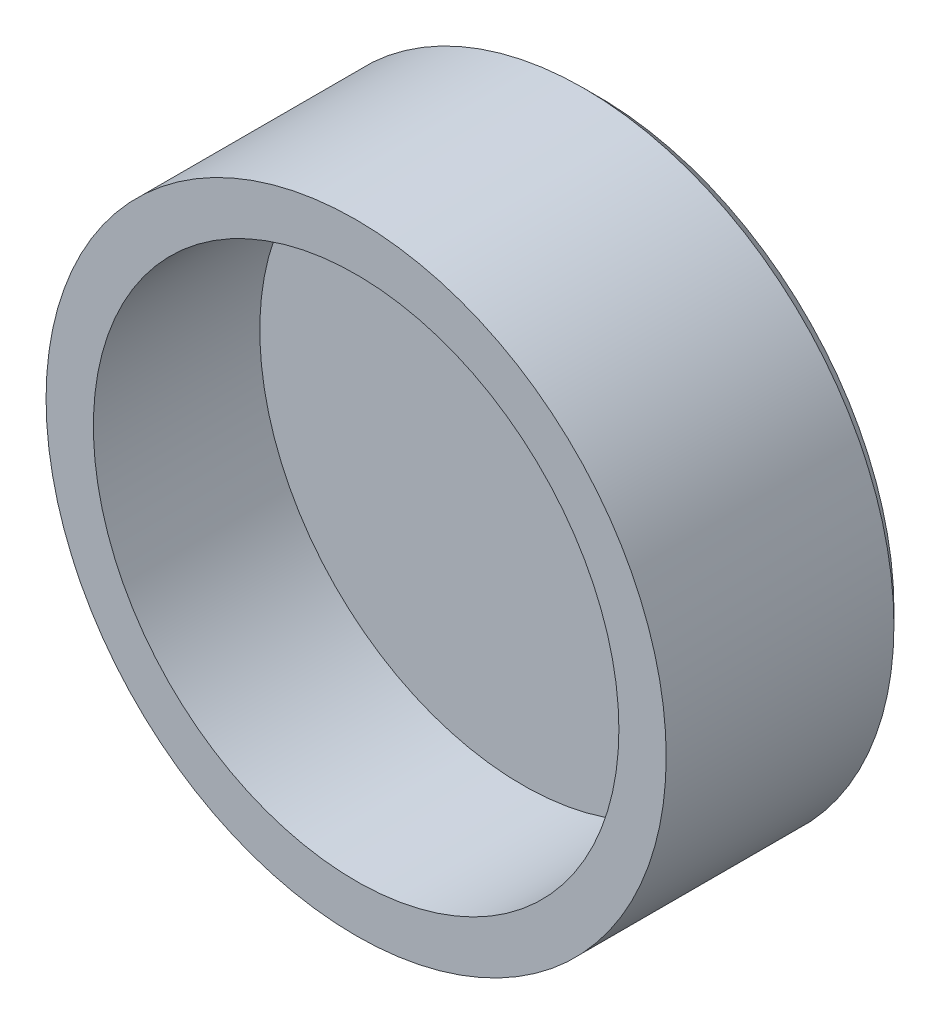
ISO-10303-21;
HEADER;
FILE_DESCRIPTION(('STEP AP214'),'2;1');
FILE_NAME('part.step','',(''),(''),'','','');
FILE_SCHEMA(('AUTOMOTIVE_DESIGN { 1 0 10303 214 1 1 1 1 }'));
ENDSEC;
DATA;
#1=APPLICATION_CONTEXT('core data for automotive mechanical design processes');
#2=APPLICATION_PROTOCOL_DEFINITION('international standard','automotive_design',2000,#1);
#3=PRODUCT_CONTEXT('',#1,'mechanical');
#4=PRODUCT('Part','Part','',(#3));
#5=PRODUCT_RELATED_PRODUCT_CATEGORY('part','',(#4));
#6=PRODUCT_DEFINITION_FORMATION('','',#4);
#7=PRODUCT_DEFINITION_CONTEXT('part definition',#1,'design');
#8=PRODUCT_DEFINITION('design','',#6,#7);
#9=PRODUCT_DEFINITION_SHAPE('','',#8);
#10=(LENGTH_UNIT() NAMED_UNIT(*) SI_UNIT(.MILLI.,.METRE.));
#11=(NAMED_UNIT(*) PLANE_ANGLE_UNIT() SI_UNIT($,.RADIAN.));
#12=(NAMED_UNIT(*) SI_UNIT($,.STERADIAN.) SOLID_ANGLE_UNIT());
#13=UNCERTAINTY_MEASURE_WITH_UNIT(LENGTH_MEASURE(1.E-05),#10,'distance_accuracy_value','');
#14=(GEOMETRIC_REPRESENTATION_CONTEXT(3) GLOBAL_UNCERTAINTY_ASSIGNED_CONTEXT((#13)) GLOBAL_UNIT_ASSIGNED_CONTEXT((#10,
#11,#12)) REPRESENTATION_CONTEXT('',''));
#15=CARTESIAN_POINT('',(0.,0.,0.));
#16=DIRECTION('',(0.,0.,1.));
#17=DIRECTION('',(1.,0.,0.));
#18=AXIS2_PLACEMENT_3D('',#15,#16,#17);
#19=CARTESIAN_POINT('',(0.,0.,-2.413));
#20=DIRECTION('',(0.,0.,1.));
#21=DIRECTION('',(1.,0.,0.));
#22=AXIS2_PLACEMENT_3D('',#19,#20,#21);
#23=PLANE('',#22);
#24=CARTESIAN_POINT('',(0.,0.,-2.413));
#25=DIRECTION('',(0.,0.,1.));
#26=DIRECTION('',(1.,0.,0.));
#27=AXIS2_PLACEMENT_3D('',#24,#25,#26);
#28=CIRCLE('',#27,3.81);
#29=CARTESIAN_POINT('',(3.81,0.,-2.413));
#30=VERTEX_POINT('',#29);
#31=EDGE_CURVE('E17',#30,#30,#28,.T.);
#32=ORIENTED_EDGE('',*,*,#31,.T.);
#33=EDGE_LOOP('',(#32));
#34=FACE_BOUND('',#33,.T.);
#35=ADVANCED_FACE('F14',(#34),#23,.T.);
#36=CARTESIAN_POINT('',(0.,0.,-3.68046));
#37=DIRECTION('',(0.,0.,1.));
#38=DIRECTION('',(1.,0.,0.));
#39=AXIS2_PLACEMENT_3D('',#36,#37,#38);
#40=CYLINDRICAL_SURFACE('',#39,3.81);
#41=ORIENTED_EDGE('',*,*,#31,.F.);
#42=EDGE_LOOP('',(#41));
#43=FACE_BOUND('',#42,.T.);
#44=CARTESIAN_POINT('',(0.,0.,0.));
#45=DIRECTION('',(0.,0.,1.));
#46=DIRECTION('',(1.,0.,0.));
#47=AXIS2_PLACEMENT_3D('',#44,#45,#46);
#48=CIRCLE('',#47,3.81);
#49=CARTESIAN_POINT('',(3.81,0.,0.));
#50=VERTEX_POINT('',#49);
#51=EDGE_CURVE('E33',#50,#50,#48,.F.);
#52=ORIENTED_EDGE('',*,*,#51,.F.);
#53=EDGE_LOOP('',(#52));
#54=FACE_BOUND('',#53,.T.);
#55=ADVANCED_FACE('F42',(#43,#54),#40,.F.);
#56=CARTESIAN_POINT('',(0.,0.,0.));
#57=DIRECTION('',(0.,0.,1.));
#58=DIRECTION('',(1.,0.,0.));
#59=AXIS2_PLACEMENT_3D('',#56,#57,#58);
#60=PLANE('',#59);
#61=ORIENTED_EDGE('',*,*,#51,.T.);
#62=EDGE_LOOP('',(#61));
#63=FACE_BOUND('',#62,.T.);
#64=CARTESIAN_POINT('',(0.,0.,0.));
#65=DIRECTION('',(0.,0.,1.));
#66=DIRECTION('',(1.,0.,0.));
#67=AXIS2_PLACEMENT_3D('',#64,#65,#66);
#68=CIRCLE('',#67,4.4958);
#69=CARTESIAN_POINT('',(4.4958,0.,0.));
#70=VERTEX_POINT('',#69);
#71=EDGE_CURVE('E29',#70,#70,#68,.F.);
#72=ORIENTED_EDGE('',*,*,#71,.F.);
#73=EDGE_LOOP('',(#72));
#74=FACE_BOUND('',#73,.T.);
#75=ADVANCED_FACE('F45',(#63,#74),#60,.T.);
#76=CARTESIAN_POINT('',(0.,0.,-3.68046));
#77=DIRECTION('',(0.,0.,1.));
#78=DIRECTION('',(1.,0.,0.));
#79=AXIS2_PLACEMENT_3D('',#76,#77,#78);
#80=CYLINDRICAL_SURFACE('',#79,4.4958);
#81=ORIENTED_EDGE('',*,*,#71,.T.);
#82=EDGE_LOOP('',(#81));
#83=FACE_BOUND('',#82,.T.);
#84=CARTESIAN_POINT('',(0.,0.,-3.30200000007608));
#85=DIRECTION('',(0.,0.,1.));
#86=DIRECTION('',(0.,1.,0.));
#87=AXIS2_PLACEMENT_3D('',#84,#85,#86);
#88=CIRCLE('',#87,4.49580000002925);
#89=CARTESIAN_POINT('',(0.,4.49580000002925,-3.30200000007608));
#90=VERTEX_POINT('',#89);
#91=EDGE_CURVE('E22',#90,#90,#88,.F.);
#92=ORIENTED_EDGE('',*,*,#91,.F.);
#93=EDGE_LOOP('',(#92));
#94=FACE_BOUND('',#93,.T.);
#95=ADVANCED_FACE('F51',(#83,#94),#80,.T.);
#96=CARTESIAN_POINT('',(0.,0.,-3.30200000013292));
#97=DIRECTION('',(0.,0.,1.));
#98=DIRECTION('',(1.,0.,0.));
#99=AXIS2_PLACEMENT_3D('',#96,#97,#98);
#100=CONICAL_SURFACE('',#99,4.49579999991556,0.785398163257578);
#101=ORIENTED_EDGE('',*,*,#91,.T.);
#102=EDGE_LOOP('',(#101));
#103=FACE_BOUND('',#102,.T.);
#104=CARTESIAN_POINT('',(0.,0.,-3.50520000000643));
#105=DIRECTION('',(0.,0.,1.));
#106=DIRECTION('',(1.,0.,0.));
#107=AXIS2_PLACEMENT_3D('',#104,#105,#106);
#108=CIRCLE('',#107,4.2926000000989);
#109=CARTESIAN_POINT('',(4.2926000000989,0.,-3.50520000000643));
#110=VERTEX_POINT('',#109);
#111=EDGE_CURVE('E10',#110,#110,#108,.T.);
#112=ORIENTED_EDGE('',*,*,#111,.T.);
#113=EDGE_LOOP('',(#112));
#114=FACE_BOUND('',#113,.T.);
#115=ADVANCED_FACE('F55',(#103,#114),#100,.T.);
#116=CARTESIAN_POINT('',(0.,0.,-3.5052));
#117=DIRECTION('',(0.,0.,1.));
#118=DIRECTION('',(1.,0.,0.));
#119=AXIS2_PLACEMENT_3D('',#116,#117,#118);
#120=PLANE('',#119);
#121=ORIENTED_EDGE('',*,*,#111,.F.);
#122=EDGE_LOOP('',(#121));
#123=FACE_BOUND('',#122,.T.);
#124=ADVANCED_FACE('F53',(#123),#120,.F.);
#125=CLOSED_SHELL('',(#35,#55,#75,#95,#115,#124));
#126=MANIFOLD_SOLID_BREP('B1',#125);
#127=ADVANCED_BREP_SHAPE_REPRESENTATION('',(#18,#126),#14);
#128=SHAPE_DEFINITION_REPRESENTATION(#9,#127);
ENDSEC;
END-ISO-10303-21;
